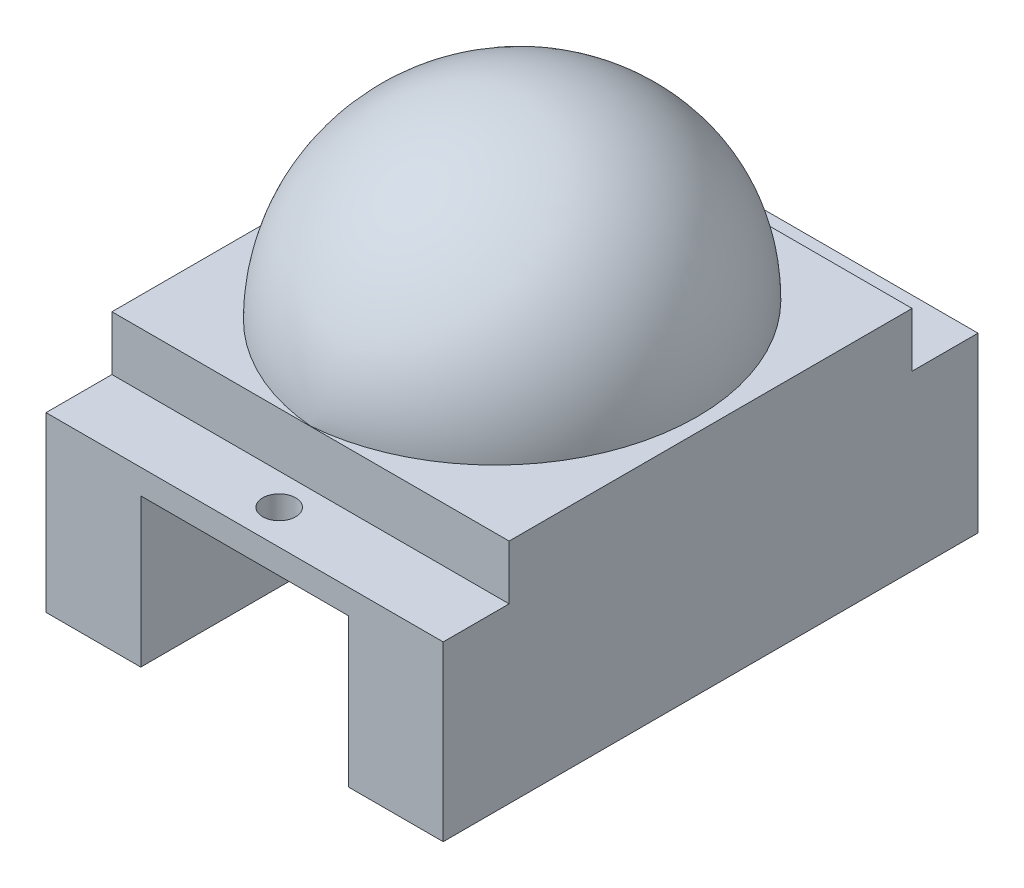
ISO-10303-21;
HEADER;
FILE_DESCRIPTION(('STEP AP214'),'2;1');
FILE_NAME('part.step','',(''),(''),'','','');
FILE_SCHEMA(('AUTOMOTIVE_DESIGN { 1 0 10303 214 1 1 1 1 }'));
ENDSEC;
DATA;
#1=APPLICATION_CONTEXT('core data for automotive mechanical design processes');
#2=APPLICATION_PROTOCOL_DEFINITION('international standard','automotive_design',2000,#1);
#3=PRODUCT_CONTEXT('',#1,'mechanical');
#4=PRODUCT('Part','Part','',(#3));
#5=PRODUCT_RELATED_PRODUCT_CATEGORY('part','',(#4));
#6=PRODUCT_DEFINITION_FORMATION('','',#4);
#7=PRODUCT_DEFINITION_CONTEXT('part definition',#1,'design');
#8=PRODUCT_DEFINITION('design','',#6,#7);
#9=PRODUCT_DEFINITION_SHAPE('','',#8);
#10=(LENGTH_UNIT() NAMED_UNIT(*) SI_UNIT(.MILLI.,.METRE.));
#11=(NAMED_UNIT(*) PLANE_ANGLE_UNIT() SI_UNIT($,.RADIAN.));
#12=(NAMED_UNIT(*) SI_UNIT($,.STERADIAN.) SOLID_ANGLE_UNIT());
#13=UNCERTAINTY_MEASURE_WITH_UNIT(LENGTH_MEASURE(1.E-05),#10,'distance_accuracy_value','');
#14=(GEOMETRIC_REPRESENTATION_CONTEXT(3) GLOBAL_UNCERTAINTY_ASSIGNED_CONTEXT((#13)) GLOBAL_UNIT_ASSIGNED_CONTEXT((#10,
#11,#12)) REPRESENTATION_CONTEXT('',''));
#15=CARTESIAN_POINT('',(0.,0.,0.));
#16=DIRECTION('',(0.,0.,1.));
#17=DIRECTION('',(1.,0.,0.));
#18=AXIS2_PLACEMENT_3D('',#15,#16,#17);
#19=CARTESIAN_POINT('',(0.,0.,0.));
#20=DIRECTION('',(0.,1.,0.));
#21=DIRECTION('',(0.,0.,1.));
#22=AXIS2_PLACEMENT_3D('',#19,#20,#21);
#23=PLANE('',#22);
#24=CARTESIAN_POINT('',(0.,0.,-14.125));
#25=DIRECTION('',(0.,1.,0.));
#26=DIRECTION('',(0.,0.,1.));
#27=AXIS2_PLACEMENT_3D('',#24,#25,#26);
#28=CIRCLE('',#27,1.);
#29=CARTESIAN_POINT('',(0.,0.,-13.125));
#30=VERTEX_POINT('',#29);
#31=EDGE_CURVE('E173',#30,#30,#28,.T.);
#32=ORIENTED_EDGE('',*,*,#31,.T.);
#33=EDGE_LOOP('',(#32));
#34=FACE_BOUND('',#33,.T.);
#35=CARTESIAN_POINT('',(0.,0.,14.125));
#36=DIRECTION('',(0.,1.,0.));
#37=DIRECTION('',(0.,0.,-1.));
#38=AXIS2_PLACEMENT_3D('',#35,#36,#37);
#39=CIRCLE('',#38,1.);
#40=CARTESIAN_POINT('',(0.,0.,13.125));
#41=VERTEX_POINT('',#40);
#42=EDGE_CURVE('E177',#41,#41,#39,.T.);
#43=ORIENTED_EDGE('',*,*,#42,.T.);
#44=EDGE_LOOP('',(#43));
#45=FACE_BOUND('',#44,.T.);
#46=DIRECTION('',(0.,0.,-1.));
#47=VECTOR('',#46,1.);
#48=CARTESIAN_POINT('',(6.3,0.,0.));
#49=LINE('',#48,#47);
#50=CARTESIAN_POINT('',(6.3,0.,16.225));
#51=VERTEX_POINT('',#50);
#52=CARTESIAN_POINT('',(6.3,0.,-16.225));
#53=VERTEX_POINT('',#52);
#54=EDGE_CURVE('E131',#51,#53,#49,.T.);
#55=ORIENTED_EDGE('',*,*,#54,.F.);
#56=DIRECTION('',(1.,0.,0.));
#57=VECTOR('',#56,1.);
#58=CARTESIAN_POINT('',(12.05,0.,16.225));
#59=LINE('',#58,#57);
#60=CARTESIAN_POINT('',(-6.3,0.,16.225));
#61=VERTEX_POINT('',#60);
#62=EDGE_CURVE('E183',#61,#51,#59,.T.);
#63=ORIENTED_EDGE('',*,*,#62,.F.);
#64=DIRECTION('',(0.,0.,-1.));
#65=VECTOR('',#64,1.);
#66=CARTESIAN_POINT('',(-6.3,0.,0.));
#67=LINE('',#66,#65);
#68=CARTESIAN_POINT('',(-6.3,0.,-16.225));
#69=VERTEX_POINT('',#68);
#70=EDGE_CURVE('E232',#61,#69,#67,.T.);
#71=ORIENTED_EDGE('',*,*,#70,.T.);
#72=DIRECTION('',(-1.,0.,0.));
#73=VECTOR('',#72,1.);
#74=CARTESIAN_POINT('',(12.05,0.,-16.225));
#75=LINE('',#74,#73);
#76=EDGE_CURVE('E199',#53,#69,#75,.T.);
#77=ORIENTED_EDGE('',*,*,#76,.F.);
#78=EDGE_LOOP('',(#55,#63,#71,#77));
#79=FACE_BOUND('',#78,.T.);
#80=ADVANCED_FACE('F35',(#34,#45,#79),#23,.F.);
#81=CARTESIAN_POINT('',(0.,1.5,0.));
#82=DIRECTION('',(0.,1.,0.));
#83=DIRECTION('',(0.,0.,1.));
#84=AXIS2_PLACEMENT_3D('',#81,#82,#83);
#85=PLANE('',#84);
#86=DIRECTION('',(1.,0.,0.));
#87=VECTOR('',#86,1.);
#88=CARTESIAN_POINT('',(-12.05,1.5,12.225));
#89=LINE('',#88,#87);
#90=CARTESIAN_POINT('',(-12.05,1.5,12.225));
#91=VERTEX_POINT('',#90);
#92=CARTESIAN_POINT('',(12.05,1.5,12.225));
#93=VERTEX_POINT('',#92);
#94=EDGE_CURVE('E161',#91,#93,#89,.T.);
#95=ORIENTED_EDGE('',*,*,#94,.F.);
#96=DIRECTION('',(0.,0.,1.));
#97=VECTOR('',#96,1.);
#98=CARTESIAN_POINT('',(-12.05,1.5,16.225));
#99=LINE('',#98,#97);
#100=CARTESIAN_POINT('',(-12.05,1.5,16.225));
#101=VERTEX_POINT('',#100);
#102=EDGE_CURVE('E189',#91,#101,#99,.T.);
#103=ORIENTED_EDGE('',*,*,#102,.T.);
#104=DIRECTION('',(1.,0.,0.));
#105=VECTOR('',#104,1.);
#106=CARTESIAN_POINT('',(12.05,1.5,16.225));
#107=LINE('',#106,#105);
#108=CARTESIAN_POINT('',(12.05,1.5,16.225));
#109=VERTEX_POINT('',#108);
#110=EDGE_CURVE('E188',#101,#109,#107,.T.);
#111=ORIENTED_EDGE('',*,*,#110,.T.);
#112=DIRECTION('',(0.,0.,-1.));
#113=VECTOR('',#112,1.);
#114=CARTESIAN_POINT('',(12.05,1.5,16.225));
#115=LINE('',#114,#113);
#116=EDGE_CURVE('E192',#109,#93,#115,.T.);
#117=ORIENTED_EDGE('',*,*,#116,.T.);
#118=EDGE_LOOP('',(#95,#103,#111,#117));
#119=FACE_BOUND('',#118,.T.);
#120=CARTESIAN_POINT('',(0.,1.5,14.125));
#121=DIRECTION('',(0.,1.,0.));
#122=DIRECTION('',(0.,0.,-1.));
#123=AXIS2_PLACEMENT_3D('',#120,#121,#122);
#124=CIRCLE('',#123,1.);
#125=CARTESIAN_POINT('',(0.,1.5,13.125));
#126=VERTEX_POINT('',#125);
#127=EDGE_CURVE('E180',#126,#126,#124,.T.);
#128=ORIENTED_EDGE('',*,*,#127,.F.);
#129=EDGE_LOOP('',(#128));
#130=FACE_BOUND('',#129,.T.);
#131=ADVANCED_FACE('F274',(#119,#130),#85,.T.);
#132=DIRECTION('',(-1.,0.,0.));
#133=VECTOR('',#132,1.);
#134=CARTESIAN_POINT('',(-12.05,1.5,-12.225));
#135=LINE('',#134,#133);
#136=CARTESIAN_POINT('',(12.05,1.5,-12.225));
#137=VERTEX_POINT('',#136);
#138=CARTESIAN_POINT('',(-12.05,1.5,-12.225));
#139=VERTEX_POINT('',#138);
#140=EDGE_CURVE('E159',#137,#139,#135,.T.);
#141=ORIENTED_EDGE('',*,*,#140,.F.);
#142=CARTESIAN_POINT('',(12.05,1.5,-16.225));
#143=VERTEX_POINT('',#142);
#144=EDGE_CURVE('E191',#137,#143,#115,.T.);
#145=ORIENTED_EDGE('',*,*,#144,.T.);
#146=DIRECTION('',(-1.,0.,0.));
#147=VECTOR('',#146,1.);
#148=CARTESIAN_POINT('',(12.05,1.5,-16.225));
#149=LINE('',#148,#147);
#150=CARTESIAN_POINT('',(-12.05,1.5,-16.225));
#151=VERTEX_POINT('',#150);
#152=EDGE_CURVE('E194',#143,#151,#149,.T.);
#153=ORIENTED_EDGE('',*,*,#152,.T.);
#154=EDGE_CURVE('E186',#151,#139,#99,.T.);
#155=ORIENTED_EDGE('',*,*,#154,.T.);
#156=EDGE_LOOP('',(#141,#145,#153,#155));
#157=FACE_BOUND('',#156,.T.);
#158=CARTESIAN_POINT('',(0.,1.5,-14.125));
#159=DIRECTION('',(0.,1.,0.));
#160=DIRECTION('',(0.,0.,1.));
#161=AXIS2_PLACEMENT_3D('',#158,#159,#160);
#162=CIRCLE('',#161,1.);
#163=CARTESIAN_POINT('',(0.,1.5,-13.125));
#164=VERTEX_POINT('',#163);
#165=EDGE_CURVE('E174',#164,#164,#162,.T.);
#166=ORIENTED_EDGE('',*,*,#165,.F.);
#167=EDGE_LOOP('',(#166));
#168=FACE_BOUND('',#167,.T.);
#169=ADVANCED_FACE('F295',(#157,#168),#85,.T.);
#170=CARTESIAN_POINT('',(-12.05,1.5,16.225));
#171=DIRECTION('',(1.,0.,0.));
#172=DIRECTION('',(0.,0.,-1.));
#173=AXIS2_PLACEMENT_3D('',#170,#171,#172);
#174=PLANE('',#173);
#175=DIRECTION('',(0.,-1.,0.));
#176=VECTOR('',#175,1.);
#177=CARTESIAN_POINT('',(-12.05,1.5,-16.225));
#178=LINE('',#177,#176);
#179=CARTESIAN_POINT('',(-12.05,-9.,-16.225));
#180=VERTEX_POINT('',#179);
#181=EDGE_CURVE('E196',#151,#180,#178,.T.);
#182=ORIENTED_EDGE('',*,*,#181,.T.);
#183=DIRECTION('',(0.,0.,-1.));
#184=VECTOR('',#183,1.);
#185=CARTESIAN_POINT('',(-12.05,-9.,0.));
#186=LINE('',#185,#184);
#187=CARTESIAN_POINT('',(-12.05,-9.,16.225));
#188=VERTEX_POINT('',#187);
#189=EDGE_CURVE('E239',#188,#180,#186,.T.);
#190=ORIENTED_EDGE('',*,*,#189,.F.);
#191=DIRECTION('',(0.,-1.,0.));
#192=VECTOR('',#191,1.);
#193=CARTESIAN_POINT('',(-12.05,1.5,16.225));
#194=LINE('',#193,#192);
#195=EDGE_CURVE('E11',#101,#188,#194,.T.);
#196=ORIENTED_EDGE('',*,*,#195,.F.);
#197=ORIENTED_EDGE('',*,*,#102,.F.);
#198=DIRECTION('',(0.,-1.,0.));
#199=VECTOR('',#198,1.);
#200=CARTESIAN_POINT('',(-12.05,4.8,12.225));
#201=LINE('',#200,#199);
#202=CARTESIAN_POINT('',(-12.05,4.8,12.225));
#203=VERTEX_POINT('',#202);
#204=EDGE_CURVE('E167',#203,#91,#201,.T.);
#205=ORIENTED_EDGE('',*,*,#204,.F.);
#206=DIRECTION('',(0.,0.,1.));
#207=VECTOR('',#206,1.);
#208=CARTESIAN_POINT('',(-12.05,4.8,-12.225));
#209=LINE('',#208,#207);
#210=CARTESIAN_POINT('',(-12.05,4.8,-12.225));
#211=VERTEX_POINT('',#210);
#212=EDGE_CURVE('E151',#211,#203,#209,.T.);
#213=ORIENTED_EDGE('',*,*,#212,.F.);
#214=DIRECTION('',(0.,-1.,0.));
#215=VECTOR('',#214,1.);
#216=CARTESIAN_POINT('',(-12.05,4.8,-12.225));
#217=LINE('',#216,#215);
#218=EDGE_CURVE('E145',#211,#139,#217,.T.);
#219=ORIENTED_EDGE('',*,*,#218,.T.);
#220=ORIENTED_EDGE('',*,*,#154,.F.);
#221=EDGE_LOOP('',(#182,#190,#196,#197,#205,#213,#219,#220));
#222=FACE_BOUND('',#221,.T.);
#223=ADVANCED_FACE('F37',(#222),#174,.F.);
#224=CARTESIAN_POINT('',(12.05,1.5,16.225));
#225=DIRECTION('',(0.,0.,-1.));
#226=DIRECTION('',(-1.,0.,0.));
#227=AXIS2_PLACEMENT_3D('',#224,#225,#226);
#228=PLANE('',#227);
#229=ORIENTED_EDGE('',*,*,#195,.T.);
#230=DIRECTION('',(-1.,0.,0.));
#231=VECTOR('',#230,1.);
#232=CARTESIAN_POINT('',(0.,-9.,16.225));
#233=LINE('',#232,#231);
#234=CARTESIAN_POINT('',(-6.3,-9.,16.225));
#235=VERTEX_POINT('',#234);
#236=EDGE_CURVE('E236',#235,#188,#233,.T.);
#237=ORIENTED_EDGE('',*,*,#236,.F.);
#238=DIRECTION('',(0.,1.,0.));
#239=VECTOR('',#238,1.);
#240=CARTESIAN_POINT('',(-6.3,-9.,16.225));
#241=LINE('',#240,#239);
#242=EDGE_CURVE('E162',#235,#61,#241,.T.);
#243=ORIENTED_EDGE('',*,*,#242,.T.);
#244=ORIENTED_EDGE('',*,*,#62,.T.);
#245=DIRECTION('',(0.,1.,0.));
#246=VECTOR('',#245,1.);
#247=CARTESIAN_POINT('',(6.3,-9.,16.225));
#248=LINE('',#247,#246);
#249=CARTESIAN_POINT('',(6.3,-9.,16.225));
#250=VERTEX_POINT('',#249);
#251=EDGE_CURVE('E223',#250,#51,#248,.T.);
#252=ORIENTED_EDGE('',*,*,#251,.F.);
#253=DIRECTION('',(-1.,0.,0.));
#254=VECTOR('',#253,1.);
#255=CARTESIAN_POINT('',(0.,-9.,16.225));
#256=LINE('',#255,#254);
#257=CARTESIAN_POINT('',(12.05,-9.,16.225));
#258=VERTEX_POINT('',#257);
#259=EDGE_CURVE('E218',#258,#250,#256,.T.);
#260=ORIENTED_EDGE('',*,*,#259,.F.);
#261=DIRECTION('',(0.,-1.,0.));
#262=VECTOR('',#261,1.);
#263=CARTESIAN_POINT('',(12.05,1.5,16.225));
#264=LINE('',#263,#262);
#265=EDGE_CURVE('E43',#109,#258,#264,.T.);
#266=ORIENTED_EDGE('',*,*,#265,.F.);
#267=ORIENTED_EDGE('',*,*,#110,.F.);
#268=EDGE_LOOP('',(#229,#237,#243,#244,#252,#260,#266,#267));
#269=FACE_BOUND('',#268,.T.);
#270=ADVANCED_FACE('F222',(#269),#228,.F.);
#271=CARTESIAN_POINT('',(12.05,1.5,16.225));
#272=DIRECTION('',(-1.,0.,0.));
#273=DIRECTION('',(0.,0.,1.));
#274=AXIS2_PLACEMENT_3D('',#271,#272,#273);
#275=PLANE('',#274);
#276=ORIENTED_EDGE('',*,*,#265,.T.);
#277=DIRECTION('',(0.,0.,1.));
#278=VECTOR('',#277,1.);
#279=CARTESIAN_POINT('',(12.05,-9.,0.));
#280=LINE('',#279,#278);
#281=CARTESIAN_POINT('',(12.05,-9.,-16.225));
#282=VERTEX_POINT('',#281);
#283=EDGE_CURVE('E210',#282,#258,#280,.T.);
#284=ORIENTED_EDGE('',*,*,#283,.F.);
#285=DIRECTION('',(0.,-1.,0.));
#286=VECTOR('',#285,1.);
#287=CARTESIAN_POINT('',(12.05,1.5,-16.225));
#288=LINE('',#287,#286);
#289=EDGE_CURVE('E202',#143,#282,#288,.T.);
#290=ORIENTED_EDGE('',*,*,#289,.F.);
#291=ORIENTED_EDGE('',*,*,#144,.F.);
#292=DIRECTION('',(0.,-1.,0.));
#293=VECTOR('',#292,1.);
#294=CARTESIAN_POINT('',(12.05,4.8,-12.225));
#295=LINE('',#294,#293);
#296=CARTESIAN_POINT('',(12.05,4.8,-12.225));
#297=VERTEX_POINT('',#296);
#298=EDGE_CURVE('E171',#297,#137,#295,.T.);
#299=ORIENTED_EDGE('',*,*,#298,.F.);
#300=DIRECTION('',(0.,0.,-1.));
#301=VECTOR('',#300,1.);
#302=CARTESIAN_POINT('',(12.05,4.8,-12.225));
#303=LINE('',#302,#301);
#304=CARTESIAN_POINT('',(12.05,4.8,12.225));
#305=VERTEX_POINT('',#304);
#306=EDGE_CURVE('E147',#305,#297,#303,.T.);
#307=ORIENTED_EDGE('',*,*,#306,.F.);
#308=DIRECTION('',(0.,-1.,0.));
#309=VECTOR('',#308,1.);
#310=CARTESIAN_POINT('',(12.05,4.8,12.225));
#311=LINE('',#310,#309);
#312=EDGE_CURVE('E158',#305,#93,#311,.T.);
#313=ORIENTED_EDGE('',*,*,#312,.T.);
#314=ORIENTED_EDGE('',*,*,#116,.F.);
#315=EDGE_LOOP('',(#276,#284,#290,#291,#299,#307,#313,#314));
#316=FACE_BOUND('',#315,.T.);
#317=ADVANCED_FACE('F208',(#316),#275,.F.);
#318=CARTESIAN_POINT('',(12.05,1.5,-16.225));
#319=DIRECTION('',(0.,0.,1.));
#320=DIRECTION('',(1.,0.,0.));
#321=AXIS2_PLACEMENT_3D('',#318,#319,#320);
#322=PLANE('',#321);
#323=ORIENTED_EDGE('',*,*,#289,.T.);
#324=DIRECTION('',(1.,0.,0.));
#325=VECTOR('',#324,1.);
#326=CARTESIAN_POINT('',(0.,-9.,-16.225));
#327=LINE('',#326,#325);
#328=CARTESIAN_POINT('',(6.3,-9.,-16.225));
#329=VERTEX_POINT('',#328);
#330=EDGE_CURVE('E220',#329,#282,#327,.T.);
#331=ORIENTED_EDGE('',*,*,#330,.F.);
#332=DIRECTION('',(0.,1.,0.));
#333=VECTOR('',#332,1.);
#334=CARTESIAN_POINT('',(6.3,-9.,-16.225));
#335=LINE('',#334,#333);
#336=EDGE_CURVE('E57',#329,#53,#335,.T.);
#337=ORIENTED_EDGE('',*,*,#336,.T.);
#338=ORIENTED_EDGE('',*,*,#76,.T.);
#339=DIRECTION('',(0.,1.,0.));
#340=VECTOR('',#339,1.);
#341=CARTESIAN_POINT('',(-6.3,-9.,-16.225));
#342=LINE('',#341,#340);
#343=CARTESIAN_POINT('',(-6.3,-9.,-16.225));
#344=VERTEX_POINT('',#343);
#345=EDGE_CURVE('E244',#344,#69,#342,.T.);
#346=ORIENTED_EDGE('',*,*,#345,.F.);
#347=DIRECTION('',(1.,0.,0.));
#348=VECTOR('',#347,1.);
#349=CARTESIAN_POINT('',(0.,-9.,-16.225));
#350=LINE('',#349,#348);
#351=EDGE_CURVE('E242',#180,#344,#350,.T.);
#352=ORIENTED_EDGE('',*,*,#351,.F.);
#353=ORIENTED_EDGE('',*,*,#181,.F.);
#354=ORIENTED_EDGE('',*,*,#152,.F.);
#355=EDGE_LOOP('',(#323,#331,#337,#338,#346,#352,#353,#354));
#356=FACE_BOUND('',#355,.T.);
#357=ADVANCED_FACE('F260',(#356),#322,.F.);
#358=CARTESIAN_POINT('',(0.,1.5,14.125));
#359=DIRECTION('',(0.,-1.,0.));
#360=DIRECTION('',(0.,0.,-1.));
#361=AXIS2_PLACEMENT_3D('',#358,#359,#360);
#362=CYLINDRICAL_SURFACE('',#361,1.);
#363=ORIENTED_EDGE('',*,*,#127,.T.);
#364=EDGE_LOOP('',(#363));
#365=FACE_BOUND('',#364,.T.);
#366=ORIENTED_EDGE('',*,*,#42,.F.);
#367=EDGE_LOOP('',(#366));
#368=FACE_BOUND('',#367,.T.);
#369=ADVANCED_FACE('F302',(#365,#368),#362,.F.);
#370=CARTESIAN_POINT('',(0.,1.5,-14.125));
#371=DIRECTION('',(0.,-1.,0.));
#372=DIRECTION('',(0.,0.,-1.));
#373=AXIS2_PLACEMENT_3D('',#370,#371,#372);
#374=CYLINDRICAL_SURFACE('',#373,1.);
#375=ORIENTED_EDGE('',*,*,#165,.T.);
#376=EDGE_LOOP('',(#375));
#377=FACE_BOUND('',#376,.T.);
#378=ORIENTED_EDGE('',*,*,#31,.F.);
#379=EDGE_LOOP('',(#378));
#380=FACE_BOUND('',#379,.T.);
#381=ADVANCED_FACE('F316',(#377,#380),#374,.F.);
#382=CARTESIAN_POINT('',(-12.05,4.8,-12.225));
#383=DIRECTION('',(0.,0.,1.));
#384=DIRECTION('',(1.,0.,0.));
#385=AXIS2_PLACEMENT_3D('',#382,#383,#384);
#386=PLANE('',#385);
#387=ORIENTED_EDGE('',*,*,#140,.T.);
#388=ORIENTED_EDGE('',*,*,#218,.F.);
#389=DIRECTION('',(-1.,0.,0.));
#390=VECTOR('',#389,1.);
#391=CARTESIAN_POINT('',(-12.05,4.8,-12.225));
#392=LINE('',#391,#390);
#393=CARTESIAN_POINT('',(0.,4.8,-12.225));
#394=VERTEX_POINT('',#393);
#395=EDGE_CURVE('E135',#394,#211,#392,.T.);
#396=ORIENTED_EDGE('',*,*,#395,.F.);
#397=EDGE_CURVE('E142',#297,#394,#392,.T.);
#398=ORIENTED_EDGE('',*,*,#397,.F.);
#399=ORIENTED_EDGE('',*,*,#298,.T.);
#400=EDGE_LOOP('',(#387,#388,#396,#398,#399));
#401=FACE_BOUND('',#400,.T.);
#402=ADVANCED_FACE('F140',(#401),#386,.F.);
#403=CARTESIAN_POINT('',(-12.05,4.8,12.225));
#404=DIRECTION('',(0.,0.,-1.));
#405=DIRECTION('',(-1.,0.,0.));
#406=AXIS2_PLACEMENT_3D('',#403,#404,#405);
#407=PLANE('',#406);
#408=ORIENTED_EDGE('',*,*,#94,.T.);
#409=ORIENTED_EDGE('',*,*,#312,.F.);
#410=DIRECTION('',(1.,0.,0.));
#411=VECTOR('',#410,1.);
#412=CARTESIAN_POINT('',(-12.05,4.8,12.225));
#413=LINE('',#412,#411);
#414=EDGE_CURVE('E152',#203,#305,#413,.T.);
#415=ORIENTED_EDGE('',*,*,#414,.F.);
#416=ORIENTED_EDGE('',*,*,#204,.T.);
#417=EDGE_LOOP('',(#408,#409,#415,#416));
#418=FACE_BOUND('',#417,.T.);
#419=ADVANCED_FACE('F272',(#418),#407,.F.);
#420=CARTESIAN_POINT('',(0.,4.8,0.));
#421=DIRECTION('',(0.,1.,0.));
#422=DIRECTION('',(0.,0.,1.));
#423=AXIS2_PLACEMENT_3D('',#420,#421,#422);
#424=PLANE('',#423);
#425=CARTESIAN_POINT('',(-1.03546689180469,4.8,-0.00830351185433179));
#426=DIRECTION('',(0.,-1.,0.));
#427=DIRECTION('',(0.,0.,1.));
#428=AXIS2_PLACEMENT_3D('',#425,#426,#427);
#429=CIRCLE('',#428,12.2605001842296);
#430=CARTESIAN_POINT('',(0.,4.8,12.2083929762913));
#431=VERTEX_POINT('',#430);
#432=EDGE_CURVE('E127',#394,#431,#429,.T.);
#433=ORIENTED_EDGE('',*,*,#432,.T.);
#434=CARTESIAN_POINT('',(1.03546689180469,4.8,-0.00830351185433179));
#435=DIRECTION('',(0.,1.,0.));
#436=DIRECTION('',(0.,0.,1.));
#437=AXIS2_PLACEMENT_3D('',#434,#435,#436);
#438=CIRCLE('',#437,12.2605001842296);
#439=EDGE_CURVE('E49',#394,#431,#438,.T.);
#440=ORIENTED_EDGE('',*,*,#439,.F.);
#441=ORIENTED_EDGE('',*,*,#395,.T.);
#442=ORIENTED_EDGE('',*,*,#212,.T.);
#443=ORIENTED_EDGE('',*,*,#414,.T.);
#444=ORIENTED_EDGE('',*,*,#306,.T.);
#445=ORIENTED_EDGE('',*,*,#397,.T.);
#446=EDGE_LOOP('',(#433,#440,#441,#442,#443,#444,#445));
#447=FACE_BOUND('',#446,.T.);
#448=ADVANCED_FACE('F134',(#447),#424,.T.);
#449=CARTESIAN_POINT('',(-6.3,-9.,0.));
#450=DIRECTION('',(1.,0.,0.));
#451=DIRECTION('',(0.,0.,-1.));
#452=AXIS2_PLACEMENT_3D('',#449,#450,#451);
#453=PLANE('',#452);
#454=ORIENTED_EDGE('',*,*,#70,.F.);
#455=ORIENTED_EDGE('',*,*,#242,.F.);
#456=DIRECTION('',(0.,0.,-1.));
#457=VECTOR('',#456,1.);
#458=CARTESIAN_POINT('',(-6.3,-9.,0.));
#459=LINE('',#458,#457);
#460=EDGE_CURVE('E233',#235,#344,#459,.T.);
#461=ORIENTED_EDGE('',*,*,#460,.T.);
#462=ORIENTED_EDGE('',*,*,#345,.T.);
#463=EDGE_LOOP('',(#454,#455,#461,#462));
#464=FACE_BOUND('',#463,.T.);
#465=ADVANCED_FACE('F253',(#464),#453,.T.);
#466=CARTESIAN_POINT('',(0.,-9.,0.));
#467=DIRECTION('',(0.,-1.,0.));
#468=DIRECTION('',(0.,0.,-1.));
#469=AXIS2_PLACEMENT_3D('',#466,#467,#468);
#470=PLANE('',#469);
#471=ORIENTED_EDGE('',*,*,#460,.F.);
#472=ORIENTED_EDGE('',*,*,#236,.T.);
#473=ORIENTED_EDGE('',*,*,#189,.T.);
#474=ORIENTED_EDGE('',*,*,#351,.T.);
#475=EDGE_LOOP('',(#471,#472,#473,#474));
#476=FACE_BOUND('',#475,.T.);
#477=ADVANCED_FACE('F279',(#476),#470,.T.);
#478=CARTESIAN_POINT('',(6.3,-9.,0.));
#479=DIRECTION('',(1.,0.,0.));
#480=DIRECTION('',(0.,0.,-1.));
#481=AXIS2_PLACEMENT_3D('',#478,#479,#480);
#482=PLANE('',#481);
#483=ORIENTED_EDGE('',*,*,#54,.T.);
#484=ORIENTED_EDGE('',*,*,#336,.F.);
#485=DIRECTION('',(0.,0.,-1.));
#486=VECTOR('',#485,1.);
#487=CARTESIAN_POINT('',(6.3,-9.,0.));
#488=LINE('',#487,#486);
#489=EDGE_CURVE('E224',#250,#329,#488,.T.);
#490=ORIENTED_EDGE('',*,*,#489,.F.);
#491=ORIENTED_EDGE('',*,*,#251,.T.);
#492=EDGE_LOOP('',(#483,#484,#490,#491));
#493=FACE_BOUND('',#492,.T.);
#494=ADVANCED_FACE('F259',(#493),#482,.F.);
#495=CARTESIAN_POINT('',(0.,-9.,0.));
#496=DIRECTION('',(0.,-1.,0.));
#497=DIRECTION('',(0.,0.,-1.));
#498=AXIS2_PLACEMENT_3D('',#495,#496,#497);
#499=PLANE('',#498);
#500=ORIENTED_EDGE('',*,*,#259,.T.);
#501=ORIENTED_EDGE('',*,*,#489,.T.);
#502=ORIENTED_EDGE('',*,*,#330,.T.);
#503=ORIENTED_EDGE('',*,*,#283,.T.);
#504=EDGE_LOOP('',(#500,#501,#502,#503));
#505=FACE_BOUND('',#504,.T.);
#506=ADVANCED_FACE('F217',(#505),#499,.T.);
#507=CARTESIAN_POINT('',(-1.03546689180469,4.8,-0.00830351185433179));
#508=DIRECTION('',(0.,-1.,0.));
#509=DIRECTION('',(1.,0.,0.));
#510=AXIS2_PLACEMENT_3D('',#507,#508,#509);
#511=CIRCLE('',#510,12.2605001842296);
#512=TRIMMED_CURVE('',#511,(PARAMETER_VALUE(-1.48624008554516)),
(PARAMETER_VALUE(1.48624008554516)),.T.,.PARAMETER.);
#513=CARTESIAN_POINT('',(0.,4.8,-0.00830351185433179));
#514=DIRECTION('',(0.,0.,1.));
#515=AXIS1_PLACEMENT('',#513,#514);
#516=SURFACE_OF_REVOLUTION('',#512,#515);
#517=ORIENTED_EDGE('',*,*,#439,.T.);
#518=ORIENTED_EDGE('',*,*,#432,.F.);
#519=EDGE_LOOP('',(#517,#518));
#520=FACE_BOUND('',#519,.T.);
#521=ADVANCED_FACE('F128',(#520),#516,.T.);
#522=CLOSED_SHELL('',(#80,#131,#169,#223,#270,#317,#357,#369,#381,#402,#419,#448,#465,#477,#494,
#506,#521));
#523=MANIFOLD_SOLID_BREP('B2',#522);
#524=ADVANCED_BREP_SHAPE_REPRESENTATION('',(#18,#523),#14);
#525=SHAPE_DEFINITION_REPRESENTATION(#9,#524);
ENDSEC;
END-ISO-10303-21;
